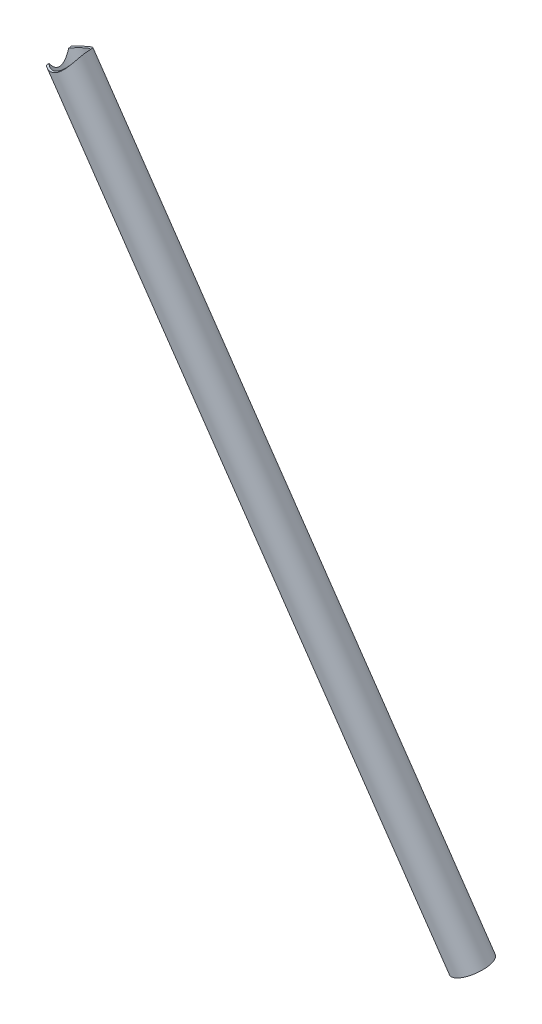
ISO-10303-21;
HEADER;
FILE_DESCRIPTION(('STEP AP214'),'2;1');
FILE_NAME('part.step','',(''),(''),'','','');
FILE_SCHEMA(('AUTOMOTIVE_DESIGN { 1 0 10303 214 1 1 1 1 }'));
ENDSEC;
DATA;
#1=APPLICATION_CONTEXT('core data for automotive mechanical design processes');
#2=APPLICATION_PROTOCOL_DEFINITION('international standard','automotive_design',2000,#1);
#3=PRODUCT_CONTEXT('',#1,'mechanical');
#4=PRODUCT('Part','Part','',(#3));
#5=PRODUCT_RELATED_PRODUCT_CATEGORY('part','',(#4));
#6=PRODUCT_DEFINITION_FORMATION('','',#4);
#7=PRODUCT_DEFINITION_CONTEXT('part definition',#1,'design');
#8=PRODUCT_DEFINITION('design','',#6,#7);
#9=PRODUCT_DEFINITION_SHAPE('','',#8);
#10=(LENGTH_UNIT() NAMED_UNIT(*) SI_UNIT(.MILLI.,.METRE.));
#11=(NAMED_UNIT(*) PLANE_ANGLE_UNIT() SI_UNIT($,.RADIAN.));
#12=(NAMED_UNIT(*) SI_UNIT($,.STERADIAN.) SOLID_ANGLE_UNIT());
#13=UNCERTAINTY_MEASURE_WITH_UNIT(LENGTH_MEASURE(1.E-05),#10,'distance_accuracy_value','');
#14=(GEOMETRIC_REPRESENTATION_CONTEXT(3) GLOBAL_UNCERTAINTY_ASSIGNED_CONTEXT((#13)) GLOBAL_UNIT_ASSIGNED_CONTEXT((#10,
#11,#12)) REPRESENTATION_CONTEXT('',''));
#15=CARTESIAN_POINT('',(0.,0.,0.));
#16=DIRECTION('',(0.,0.,1.));
#17=DIRECTION('',(1.,0.,0.));
#18=AXIS2_PLACEMENT_3D('',#15,#16,#17);
#19=CARTESIAN_POINT('',(15.0351503322684,521.737226724999,283.725227880223));
#20=DIRECTION('',(-0.025807832155009,0.13067423307069,-0.991089400917418));
#21=DIRECTION('',(-0.0275402605355425,0.99095038035367,0.131373047945732));
#22=AXIS2_PLACEMENT_3D('',#19,#20,#21);
#23=CYLINDRICAL_SURFACE('',#22,11.1125);
#24=CARTESIAN_POINT('',(24.7252163951127,515.029909267495,290.407107725878));
#25=CARTESIAN_POINT('',(24.7323279749911,515.01397883599,290.565639073504));
#26=CARTESIAN_POINT('',(24.7356435248489,514.991797183816,290.723713167724));
#27=CARTESIAN_POINT('',(24.734652464094,514.935150781067,291.037616266483));
#28=CARTESIAN_POINT('',(24.7303458633062,514.900686046325,291.193445273914));
#29=CARTESIAN_POINT('',(24.7141170765286,514.8200534236,291.501708249456));
#30=CARTESIAN_POINT('',(24.7021912873525,514.773880004704,291.654140575928));
#31=CARTESIAN_POINT('',(24.6707553996171,514.670724058833,291.954558815772));
#32=CARTESIAN_POINT('',(24.6512418901387,514.613736676548,292.102542697152));
#33=CARTESIAN_POINT('',(24.6048333676287,514.490477145692,292.392233072193));
#34=CARTESIAN_POINT('',(24.5779868072987,514.424267294314,292.533973915781));
#35=CARTESIAN_POINT('',(24.5169029313781,514.283473577166,292.811607206514));
#36=CARTESIAN_POINT('',(24.4826628261833,514.208886555778,292.947497422928));
#37=CARTESIAN_POINT('',(24.3689080405575,513.974423275426,293.345628003844));
#38=CARTESIAN_POINT('',(24.2783322768033,513.803771508296,293.598495189967));
#39=CARTESIAN_POINT('',(24.0568754012458,513.424843172808,294.100949894369));
#40=CARTESIAN_POINT('',(23.9228290349469,513.214504796005,294.347580943422));
#41=CARTESIAN_POINT('',(23.6945151438777,512.889991382476,294.690547523063));
#42=CARTESIAN_POINT('',(23.6138087207831,512.780245324311,294.800435413367));
#43=CARTESIAN_POINT('',(23.4431584649064,512.558952576729,295.010944749));
#44=CARTESIAN_POINT('',(23.3532129706991,512.447405566504,295.11156452149));
#45=CARTESIAN_POINT('',(23.1530614639427,512.210833219292,295.31423016615));
#46=CARTESIAN_POINT('',(23.0417156508309,512.085747625232,295.415083548591));
#47=CARTESIAN_POINT('',(22.8075487262916,511.8367803681,295.604018791155));
#48=CARTESIAN_POINT('',(22.6847323467235,511.712898231656,295.692105879721));
#49=CARTESIAN_POINT('',(22.42779400376,511.468073627988,295.854812388712));
#50=CARTESIAN_POINT('',(22.2936741101143,511.34713062779,295.929434266881));
#51=CARTESIAN_POINT('',(22.0145406073303,511.109953609795,296.064437899635));
#52=CARTESIAN_POINT('',(21.8695283841565,510.993718995779,296.124821461901));
#53=CARTESIAN_POINT('',(21.5800688472528,510.775805403807,296.226796524069));
#54=CARTESIAN_POINT('',(21.4363224455463,510.673679914623,296.269422942594));
#55=CARTESIAN_POINT('',(21.140900450593,510.476369333325,296.341180579815));
#56=CARTESIAN_POINT('',(20.9892251631707,510.381183973862,296.370312318588));
#57=CARTESIAN_POINT('',(20.6791858683787,510.19908602396,296.414626173658));
#58=CARTESIAN_POINT('',(20.5208274400097,510.112166722904,296.429819693556));
#59=CARTESIAN_POINT('',(20.1986688245854,509.947596696398,296.446035659298));
#60=CARTESIAN_POINT('',(20.0348692343442,509.869944958699,296.447059654218));
#61=CARTESIAN_POINT('',(19.7233956486199,509.733507121336,296.435631252214));
#62=CARTESIAN_POINT('',(19.5761606418642,509.673575212822,296.42478999255));
#63=CARTESIAN_POINT('',(19.2798011742933,509.56189490792,296.392232143844));
#64=CARTESIAN_POINT('',(19.1306767409935,509.510146392505,296.370515712996));
#65=CARTESIAN_POINT('',(18.8316993609169,509.415036717841,296.31644138339));
#66=CARTESIAN_POINT('',(18.6818464440169,509.371675217548,296.284083917477));
#67=CARTESIAN_POINT('',(18.3825308949109,509.293349528262,296.209064229124));
#68=CARTESIAN_POINT('',(18.2330682751422,509.258385603712,296.166401682259));
#69=CARTESIAN_POINT('',(17.9368462675909,509.196961200137,296.07157671821));
#70=CARTESIAN_POINT('',(17.7900747304203,509.170432219388,296.019496516607));
#71=CARTESIAN_POINT('',(17.4989228359527,509.125181436046,295.90604468985));
#72=CARTESIAN_POINT('',(17.3545432721467,509.106462176277,295.844670047303));
#73=CARTESIAN_POINT('',(16.9264216588675,509.061455403937,295.647305044781));
#74=CARTESIAN_POINT('',(16.6474926797553,509.046278090173,295.498007909168));
#75=CARTESIAN_POINT('',(16.0808259437231,509.041163817952,295.15015701178));
#76=CARTESIAN_POINT('',(15.7952490973984,509.054050498065,294.948073488554));
#77=CARTESIAN_POINT('',(15.2547601619044,509.104043560433,294.508564699055));
#78=CARTESIAN_POINT('',(14.9998840774663,509.141178058301,294.271098653358));
#79=CARTESIAN_POINT('',(14.5019860325536,509.237184975453,293.735313055107));
#80=CARTESIAN_POINT('',(14.26337663298,509.298004142303,293.433169871913));
#81=CARTESIAN_POINT('',(13.9495382830707,509.396014702563,292.953195617642));
#82=CARTESIAN_POINT('',(13.8522761802879,509.429812856624,292.788755448101));
#83=CARTESIAN_POINT('',(13.6739003127993,509.498214725531,292.451451416934));
#84=CARTESIAN_POINT('',(13.5927815003187,509.532818184777,292.278590209557));
#85=CARTESIAN_POINT('',(13.4639134711017,509.593971365636,291.96352986672));
#86=CARTESIAN_POINT('',(13.4127401430596,509.620650285813,291.822746864901));
#87=CARTESIAN_POINT('',(13.3220933445353,509.672931436003,291.537277188677));
#88=CARTESIAN_POINT('',(13.2826173762912,509.698533894872,291.392591354861));
#89=CARTESIAN_POINT('',(13.2160367924545,509.748052446225,291.100253373594));
#90=CARTESIAN_POINT('',(13.1889208128963,509.771970070594,290.952604081748));
#91=CARTESIAN_POINT('',(13.147478653559,509.817679147622,290.655185959703));
#92=CARTESIAN_POINT('',(13.1331526855551,509.839470565071,290.505417094449));
#93=CARTESIAN_POINT('',(13.1175188084756,509.880661240297,290.204588110799));
#94=CARTESIAN_POINT('',(13.1162351420492,509.900055977146,290.053526109965));
#95=CARTESIAN_POINT('',(13.1267242049562,509.936292883935,289.751552968335));
#96=CARTESIAN_POINT('',(13.1384969838443,509.953135044186,289.600641828115));
#97=CARTESIAN_POINT('',(13.174819750872,509.98435686082,289.300061418634));
#98=CARTESIAN_POINT('',(13.1993743277235,509.998735630371,289.150392614993));
#99=CARTESIAN_POINT('',(13.2607703023273,510.025292976521,288.853348378321));
#100=CARTESIAN_POINT('',(13.2976166671967,510.037470660589,288.705973897667));
#101=CARTESIAN_POINT('',(13.3823196415933,510.059864647886,288.41661156812));
#102=CARTESIAN_POINT('',(13.4300090393212,510.070106806317,288.274576615509));
#103=CARTESIAN_POINT('',(13.535978051725,510.089336773497,287.994406842118));
#104=CARTESIAN_POINT('',(13.5942611367829,510.098324169487,287.856273316588));
#105=CARTESIAN_POINT('',(13.78388208025,510.12421491902,287.448745319335));
#106=CARTESIAN_POINT('',(13.9300356601097,510.140057018185,287.186076624413));
#107=CARTESIAN_POINT('',(14.2816035241247,510.176168855485,286.643644412397));
#108=CARTESIAN_POINT('',(14.4927009073853,510.196743949514,286.367583843419));
#109=CARTESIAN_POINT('',(14.8374360671378,510.234629207713,285.979397120125));
#110=CARTESIAN_POINT('',(14.9571278646831,510.24844083397,285.854236256914));
#111=CARTESIAN_POINT('',(15.2051361902414,510.279219284787,285.613090081993));
#112=CARTESIAN_POINT('',(15.3334541859967,510.296186647166,285.497106339111));
#113=CARTESIAN_POINT('',(15.6140154682449,510.336352607303,285.261434716198));
#114=CARTESIAN_POINT('',(15.7672654167405,510.360059530498,285.143028991462));
#115=CARTESIAN_POINT('',(16.0822557435483,510.413375129501,284.919713250058));
#116=CARTESIAN_POINT('',(16.2439927618229,510.442981482512,284.814797948442));
#117=CARTESIAN_POINT('',(16.5746943099166,510.508953532469,284.619500125246));
#118=CARTESIAN_POINT('',(16.7436579248454,510.545318375724,284.529115770896));
#119=CARTESIAN_POINT('',(17.0873696631691,510.625501969115,284.36399655714));
#120=CARTESIAN_POINT('',(17.2621171224285,510.669319865821,284.289259908141));
#121=CARTESIAN_POINT('',(17.6049911551176,510.761980683825,284.160575748001));
#122=CARTESIAN_POINT('',(17.7728728599078,510.810355086212,284.105639381951));
#123=CARTESIAN_POINT('',(18.1107918811863,510.914295752527,284.01136292293));
#124=CARTESIAN_POINT('',(18.2808291344433,510.969861805933,283.972022373555));
#125=CARTESIAN_POINT('',(18.6212660743231,511.088087254652,283.9096391246));
#126=CARTESIAN_POINT('',(18.7916653162436,511.150740429232,283.886582258809));
#127=CARTESIAN_POINT('',(19.1312483446188,511.282871809666,283.857158162195));
#128=CARTESIAN_POINT('',(19.3004322751093,511.352349191916,283.85078891993));
#129=CARTESIAN_POINT('',(19.6150949624502,511.488564229659,283.854635485356));
#130=CARTESIAN_POINT('',(19.76091560847,511.554576362402,283.862895826967));
#131=CARTESIAN_POINT('',(20.0492282721972,511.690876450904,283.89225398734));
#132=CARTESIAN_POINT('',(20.191720367673,511.761164306625,283.913351505861));
#133=CARTESIAN_POINT('',(20.4723674740059,511.905365972105,283.968123384607));
#134=CARTESIAN_POINT('',(20.6105227531925,511.979279556803,284.00179696505));
#135=CARTESIAN_POINT('',(20.881648456471,512.130006033375,284.081308067545));
#136=CARTESIAN_POINT('',(21.0146187461448,512.206819000312,284.127145904709));
#137=CARTESIAN_POINT('',(21.2723437668193,512.361164626129,284.229535966082));
#138=CARTESIAN_POINT('',(21.3972028161609,512.438659926269,284.285882198338));
#139=CARTESIAN_POINT('',(21.640736791097,512.594913003224,284.409220901092));
#140=CARTESIAN_POINT('',(21.7594096938806,512.673671182116,284.476216825298));
#141=CARTESIAN_POINT('',(22.1054756423195,512.910616137956,284.692247382908));
#142=CARTESIAN_POINT('',(22.3230977520452,513.069583704717,284.856398203566));
#143=CARTESIAN_POINT('',(22.750569471247,513.398652385329,285.23800608341));
#144=CARTESIAN_POINT('',(22.9574570122535,513.568273713616,285.459155682984));
#145=CARTESIAN_POINT('',(23.3371929304476,513.893775509721,285.938392526818));
#146=CARTESIAN_POINT('',(23.5100043322094,514.049640951092,286.196519375988));
#147=CARTESIAN_POINT('',(23.7526386337022,514.274318321607,286.622891814294));
#148=CARTESIAN_POINT('',(23.8342181290308,514.35115415025,286.780427348649));
#149=CARTESIAN_POINT('',(23.98693945977,514.49594612228,287.104504034856));
#150=CARTESIAN_POINT('',(24.0580788176747,514.563900157548,287.271047311507));
#151=CARTESIAN_POINT('',(24.1898579311647,514.689015192206,287.612033742643));
#152=CARTESIAN_POINT('',(24.25050370529,514.746182380052,287.786472295915));
#153=CARTESIAN_POINT('',(24.361278742731,514.847823324948,288.142157757021));
#154=CARTESIAN_POINT('',(24.4114151573083,514.892305721044,288.323399935553));
#155=CARTESIAN_POINT('',(24.493682023257,514.960555280577,288.660965535446));
#156=CARTESIAN_POINT('',(24.5274190366291,514.986531686295,288.816453095353));
#157=CARTESIAN_POINT('',(24.587413721282,515.027314179016,289.130244379657));
#158=CARTESIAN_POINT('',(24.6136754852917,515.042126385812,289.288546512425));
#159=CARTESIAN_POINT('',(24.6586127974892,515.059748551718,289.606745350198));
#160=CARTESIAN_POINT('',(24.6772955226889,515.062569889759,289.766640399047));
#161=CARTESIAN_POINT('',(24.7070112467207,515.055683229131,290.086881232234));
#162=CARTESIAN_POINT('',(24.7180442839283,515.045975293318,290.247227014305));
#163=CARTESIAN_POINT('',(24.7252163951127,515.029909267495,290.407107725878));
#164=B_SPLINE_CURVE_WITH_KNOTS('',3,(#24,#25,#26,#27,#28,#29,#30,#31,#32,#33,#34,#35,#36,#37,
#38,#39,#40,#41,#42,#43,#44,#45,#46,#47,#48,#49,#50,#51,#52,#53,#54,#55,#56,#57,#58,#59,#60,#61,
#62,#63,#64,#65,#66,#67,#68,#69,#70,#71,#72,#73,#74,#75,#76,#77,#78,#79,#80,#81,#82,#83,#84,#85,
#86,#87,#88,#89,#90,#91,#92,#93,#94,#95,#96,#97,#98,#99,#100,#101,#102,#103,#104,#105,#106,#107,
#108,#109,#110,#111,#112,#113,#114,#115,#116,#117,#118,#119,#120,#121,#122,#123,#124,#125,#126,
#127,#128,#129,#130,#131,#132,#133,#134,#135,#136,#137,#138,#139,#140,#141,#142,#143,#144,#145,
#146,#147,#148,#149,#150,#151,#152,#153,#154,#155,#156,#157,#158,#159,#160,#161,#162,#163),
.UNSPECIFIED.,.T.,.F.,(4,2,2,2,2,2,2,2,2,2,2,2,2,2,2,2,2,2,2,2,2,2,2,2,2,2,2,2,2,2,2,2,2,2,2,2,
2,2,2,2,2,2,2,2,2,2,2,2,2,2,2,2,2,2,2,2,2,2,2,2,2,2,2,2,2,2,2,2,2,4),(0.,0.478297612294535,
0.956594608077915,1.435117962641,1.91385667766053,2.3895056343558,2.86533436923736,
3.81644521031909,4.86441517873111,5.38907969370448,5.91383872271919,6.49956495347832,
7.08505061770699,7.67042930751637,8.2557336381903,8.79918974478956,9.34262490522389,
9.88561505483835,10.4285458419421,10.9059672571717,11.383381727763,11.8607767809716,
12.3381868655482,12.8116144504028,13.2851960619561,14.231711732552,15.2778136761318,
16.3251307455571,17.4880315710523,18.0694090006118,18.6506043551841,19.1066039308711,
19.5625060657216,20.0179881873727,20.4734778506953,20.9298140103563,21.3861519020153,
21.8426537337386,22.2993402619771,22.7494117812481,23.1996310058749,24.0996132178747,
25.1396790954679,25.6604800223998,26.1813697886757,26.7659721610039,27.3503448097648,
27.9346436944306,28.5188757176009,29.0675289882367,29.6161662016176,30.1643255306841,
30.7124187843174,31.1926633992875,31.6728967825418,32.1531003937591,32.63331644572,
33.1049553855228,33.5767475916081,34.5196642108363,35.5570304122959,36.5955161214292,
37.1749244925082,37.7544701390261,38.3336822803769,38.9124989988574,39.3955934331605,
39.8784228603171,40.3607939961995,40.8431627121861),.UNSPECIFIED.);
#165=CARTESIAN_POINT('',(15.3105922221532,510.293544462506,285.520160320601));
#166=VERTEX_POINT('',#165);
#167=CARTESIAN_POINT('',(15.5509177758199,509.07669070958,294.749300822527));
#168=VERTEX_POINT('',#167);
#169=EDGE_CURVE('E83',#166,#168,#164,.T.);
#170=ORIENTED_EDGE('',*,*,#169,.F.);
#171=DIRECTION('',(-0.025807832155009,0.13067423307069,-0.991089400917418));
#172=VECTOR('',#171,1.);
#173=CARTESIAN_POINT('',(15.2259053312563,510.722344311041,282.267958451786));
#174=LINE('',#173,#172);
#175=CARTESIAN_POINT('',(15.3371595362422,510.159024702284,286.540415847929));
#176=VERTEX_POINT('',#175);
#177=EDGE_CURVE('E77',#166,#176,#174,.F.);
#178=ORIENTED_EDGE('',*,*,#177,.T.);
#179=CARTESIAN_POINT('',(24.2599339885423,514.327498487421,290.347925247683));
#180=CARTESIAN_POINT('',(24.2665977678887,514.312570832167,290.492243587058));
#181=CARTESIAN_POINT('',(24.2694720972503,514.292353620912,290.636193405875));
#182=CARTESIAN_POINT('',(24.267616103634,514.241517199068,290.92224958169));
#183=CARTESIAN_POINT('',(24.2628827370719,514.210893829189,291.064355177946));
#184=CARTESIAN_POINT('',(24.2458123478311,514.139669673822,291.345771646786));
#185=CARTESIAN_POINT('',(24.2334652944163,514.09905576869,291.485078581828));
#186=CARTESIAN_POINT('',(24.2012057233069,514.00856293883,291.759805391615));
#187=CARTESIAN_POINT('',(24.1812899712415,513.958680057807,291.895223577914));
#188=CARTESIAN_POINT('',(24.1340946042865,513.850836942013,292.160583096472));
#189=CARTESIAN_POINT('',(24.1068562437847,513.792922813076,292.290550534206));
#190=CARTESIAN_POINT('',(24.0450441117905,513.669775723568,292.545185858064));
#191=CARTESIAN_POINT('',(24.0104674765928,513.604539910463,292.669851652396));
#192=CARTESIAN_POINT('',(23.8958457066885,513.39940857597,293.035008368291));
#193=CARTESIAN_POINT('',(23.8048681425951,513.24999352205,293.266887487285));
#194=CARTESIAN_POINT('',(23.5858290415486,512.921470312976,293.721726662987));
#195=CARTESIAN_POINT('',(23.4553851877204,512.740943518084,293.942493545481));
#196=CARTESIAN_POINT('',(23.1609983474969,512.369266927789,294.350698860492));
#197=CARTESIAN_POINT('',(22.9970371613492,512.178111402263,294.53811908208));
#198=CARTESIAN_POINT('',(22.7188064484503,511.882288041986,294.798823841131));
#199=CARTESIAN_POINT('',(22.6160551952581,511.778004085769,294.885134856778));
#200=CARTESIAN_POINT('',(22.4010404019433,511.57046392781,295.046363797508));
#201=CARTESIAN_POINT('',(22.2887804713344,511.467207352557,295.121286015887));
#202=CARTESIAN_POINT('',(22.0550682585301,511.263153377807,295.259131168239));
#203=CARTESIAN_POINT('',(21.9336173439999,511.162355615366,295.322055882616));
#204=CARTESIAN_POINT('',(21.6820071828257,510.964616618028,295.435306590086));
#205=CARTESIAN_POINT('',(21.5518487943076,510.867675004603,295.485633822357));
#206=CARTESIAN_POINT('',(21.2916778609139,510.684741908099,295.570459860081));
#207=CARTESIAN_POINT('',(21.1621339396625,510.598442824795,295.605732720474));
#208=CARTESIAN_POINT('',(20.8968072925251,510.431548212373,295.664234523182));
#209=CARTESIAN_POINT('',(20.7610252326286,510.350952076724,295.687464747941));
#210=CARTESIAN_POINT('',(20.4842875904614,510.196479485184,295.721569330284));
#211=CARTESIAN_POINT('',(20.3433350243739,510.122599196457,295.732450776748));
#212=CARTESIAN_POINT('',(20.0573518149983,509.982336670433,295.74171741672));
#213=CARTESIAN_POINT('',(19.9123214913752,509.915953847428,295.740103587055));
#214=CARTESIAN_POINT('',(19.6335654556257,509.797312214985,295.72514185474));
#215=CARTESIAN_POINT('',(19.5000931035253,509.744309118542,295.71293675324));
#216=CARTESIAN_POINT('',(19.2318357035216,509.645235915631,295.678436878667));
#217=CARTESIAN_POINT('',(19.0970502556067,509.599167996933,295.656138930559));
#218=CARTESIAN_POINT('',(18.8272862817447,509.514161913727,295.601682314703));
#219=CARTESIAN_POINT('',(18.6923078450643,509.475221132656,295.569527277399));
#220=CARTESIAN_POINT('',(18.4230607059244,509.404439817625,295.495645323635));
#221=CARTESIAN_POINT('',(18.288792296173,509.372602018241,295.453914733182));
#222=CARTESIAN_POINT('',(18.0219877756401,509.315916415236,295.361255191621));
#223=CARTESIAN_POINT('',(17.8894514206833,509.291067615984,295.310327552394));
#224=CARTESIAN_POINT('',(17.6269725579787,509.248089576918,295.19966991556));
#225=CARTESIAN_POINT('',(17.4970309799625,509.229962706159,295.139936824933));
#226=CARTESIAN_POINT('',(17.1124140168243,509.185175737832,294.948148719384));
#227=CARTESIAN_POINT('',(16.8627708806616,509.168073268453,294.803443667686));
#228=CARTESIAN_POINT('',(16.3613966334699,509.155179810693,294.469052480063));
#229=CARTESIAN_POINT('',(16.1115701027324,509.161485121368,294.276459728523));
#230=CARTESIAN_POINT('',(15.6421365658873,509.19434648289,293.858344966381));
#231=CARTESIAN_POINT('',(15.4225544263923,509.220919081324,293.632796169943));
#232=CARTESIAN_POINT('',(15.1136820342353,509.272439217976,293.263159952051));
#233=CARTESIAN_POINT('',(15.0109605312589,509.292498986694,293.129395679525));
#234=CARTESIAN_POINT('',(14.8176285893567,509.335586988886,292.853858104151));
#235=CARTESIAN_POINT('',(14.7270130468281,509.358613963358,292.712088212383));
#236=CARTESIAN_POINT('',(14.5591092006629,509.40658231322,292.421189695313));
#237=CARTESIAN_POINT('',(14.4818191632677,509.431523438953,292.27206203057));
#238=CARTESIAN_POINT('',(14.3418224158107,509.482268528862,291.96733387457));
#239=CARTESIAN_POINT('',(14.2791069063427,509.508071961596,291.811737356153));
#240=CARTESIAN_POINT('',(14.1728142843882,509.557963175026,291.50498965095));
#241=CARTESIAN_POINT('',(14.1282850343721,509.582057259426,291.354169719927));
#242=CARTESIAN_POINT('',(14.0538682898824,509.629435482211,291.048905548497));
#243=CARTESIAN_POINT('',(14.0239729304103,509.652720049407,290.894463301784));
#244=CARTESIAN_POINT('',(13.9793987005993,509.697919815873,290.583293175973));
#245=CARTESIAN_POINT('',(13.9647105423212,509.719835843297,290.42656675135));
#246=CARTESIAN_POINT('',(13.9508015035554,509.761955073257,290.112207198471));
#247=CARTESIAN_POINT('',(13.9515791224949,509.782158441773,289.954574159663));
#248=CARTESIAN_POINT('',(13.9674728651156,509.818347966462,289.659361805479));
#249=CARTESIAN_POINT('',(13.9808072155842,509.834546848939,289.521708954535));
#250=CARTESIAN_POINT('',(14.0190337356978,509.865609367146,289.247823915433));
#251=CARTESIAN_POINT('',(14.0439295195598,509.880472583598,289.111592185158));
#252=CARTESIAN_POINT('',(14.1048520432464,509.909048136797,288.84153689874));
#253=CARTESIAN_POINT('',(14.1408775589233,509.922760599903,288.707713079467));
#254=CARTESIAN_POINT('',(14.2235055484344,509.949338985159,288.443267006553));
#255=CARTESIAN_POINT('',(14.2701121835833,509.962204571676,288.312646034974));
#256=CARTESIAN_POINT('',(14.427558604508,510.000732586414,287.920097352536));
#257=CARTESIAN_POINT('',(14.5544461188671,510.025641783151,287.664363558943));
#258=CARTESIAN_POINT('',(14.8444781929245,510.077293499904,287.174748933466));
#259=CARTESIAN_POINT('',(15.0076393569071,510.104036855619,286.940878179266));
#260=CARTESIAN_POINT('',(15.3883368582892,510.167401348712,286.469850672099));
#261=CARTESIAN_POINT('',(15.6101991970098,510.204858240379,286.236291248842));
#262=CARTESIAN_POINT('',(16.0864646451804,510.293113208736,285.807554105623));
#263=CARTESIAN_POINT('',(16.3408836243684,510.343917804569,285.61239522253));
#264=CARTESIAN_POINT('',(16.7471880057849,510.435006016121,285.349069510807));
#265=CARTESIAN_POINT('',(16.8902312752328,510.468785735717,285.26467399613));
#266=CARTESIAN_POINT('',(17.1819140991429,510.541800238342,285.108965440312));
#267=CARTESIAN_POINT('',(17.3305512391346,510.581032687073,285.037646831128));
#268=CARTESIAN_POINT('',(17.6320759966652,510.665330558691,284.908975042953));
#269=CARTESIAN_POINT('',(17.7849617483509,510.710393451857,284.851615838148));
#270=CARTESIAN_POINT('',(18.0936196826945,510.806575135967,284.751623822215));
#271=CARTESIAN_POINT('',(18.2493915173544,510.857693200749,284.708989247641));
#272=CARTESIAN_POINT('',(18.5488528797145,510.961336411961,284.642113952171));
#273=CARTESIAN_POINT('',(18.6924328867322,511.013364902736,284.616609317874));
#274=CARTESIAN_POINT('',(18.9794762034642,511.122309771902,284.578840127703));
#275=CARTESIAN_POINT('',(19.1229395225837,511.17922570643,284.566574370886));
#276=CARTESIAN_POINT('',(19.4084461062326,511.297588522602,284.555486966842));
#277=CARTESIAN_POINT('',(19.5504898952338,511.359033654832,284.556660155547));
#278=CARTESIAN_POINT('',(19.8319906867442,511.485978700238,284.572449453974));
#279=CARTESIAN_POINT('',(19.971447804667,511.551478431936,284.587064962439));
#280=CARTESIAN_POINT('',(20.2357144511774,511.680560723792,284.62786359478));
#281=CARTESIAN_POINT('',(20.3608084148861,511.743883257964,284.653037229663));
#282=CARTESIAN_POINT('',(20.6070901879322,511.872867447203,284.714346096011));
#283=CARTESIAN_POINT('',(20.7282767495852,511.938529835598,284.750484791157));
#284=CARTESIAN_POINT('',(20.9659855971738,512.071519653263,284.833325726752));
#285=CARTESIAN_POINT('',(21.0825092932786,512.138846569019,284.880024744637));
#286=CARTESIAN_POINT('',(21.3103901575126,512.274511799566,284.983519094897));
#287=CARTESIAN_POINT('',(21.4217453253371,512.342850492656,285.040318295794));
#288=CARTESIAN_POINT('',(21.7537094890732,512.552354855466,285.228730927236));
#289=CARTESIAN_POINT('',(21.9653250130004,512.694111343246,285.375941427098));
#290=CARTESIAN_POINT('',(22.3620506988447,512.972622323356,285.706129787652));
#291=CARTESIAN_POINT('',(22.5471504855472,513.109374842209,285.889121583158));
#292=CARTESIAN_POINT('',(22.9071665716996,513.384793126425,286.306244325203));
#293=CARTESIAN_POINT('',(23.079184875628,513.522267239188,286.543668006062));
#294=CARTESIAN_POINT('',(23.3896127814508,513.77482934488,287.050881920683));
#295=CARTESIAN_POINT('',(23.5279870536688,513.889893780349,287.320705737674));
#296=CARTESIAN_POINT('',(23.7128206043828,514.04087960777,287.752024676643));
#297=CARTESIAN_POINT('',(23.7717682701816,514.088470253885,287.904282456697));
#298=CARTESIAN_POINT('',(23.8800311110231,514.173331814476,288.214945879791));
#299=CARTESIAN_POINT('',(23.9293510044035,514.210607787681,288.373348465553));
#300=CARTESIAN_POINT('',(24.0181012075182,514.273395190445,288.694744354279));
#301=CARTESIAN_POINT('',(24.0575558165352,514.2989356586,288.857725255396));
#302=CARTESIAN_POINT('',(24.1265318467687,514.337150210375,289.187179844928));
#303=CARTESIAN_POINT('',(24.1560599006286,514.349832896668,289.353651121845));
#304=CARTESIAN_POINT('',(24.2005957087189,514.360370722131,289.658229656227));
#305=CARTESIAN_POINT('',(24.2172638227149,514.360492959357,289.796020742711));
#306=CARTESIAN_POINT('',(24.2437515547488,514.351184701362,290.071961631117));
#307=CARTESIAN_POINT('',(24.2535705516675,514.341753339953,290.210111464432));
#308=CARTESIAN_POINT('',(24.2599339885423,514.327498487421,290.347925247683));
#309=B_SPLINE_CURVE_WITH_KNOTS('',3,(#179,#180,#181,#182,#183,#184,#185,#186,#187,#188,#189,
#190,#191,#192,#193,#194,#195,#196,#197,#198,#199,#200,#201,#202,#203,#204,#205,#206,#207,#208,
#209,#210,#211,#212,#213,#214,#215,#216,#217,#218,#219,#220,#221,#222,#223,#224,#225,#226,#227,
#228,#229,#230,#231,#232,#233,#234,#235,#236,#237,#238,#239,#240,#241,#242,#243,#244,#245,#246,
#247,#248,#249,#250,#251,#252,#253,#254,#255,#256,#257,#258,#259,#260,#261,#262,#263,#264,#265,
#266,#267,#268,#269,#270,#271,#272,#273,#274,#275,#276,#277,#278,#279,#280,#281,#282,#283,#284,
#285,#286,#287,#288,#289,#290,#291,#292,#293,#294,#295,#296,#297,#298,#299,#300,#301,#302,#303,
#304,#305,#306,#307,#308),.UNSPECIFIED.,.T.,.F.,(4,2,2,2,2,2,2,2,2,2,2,2,2,2,2,2,2,2,2,2,2,2,2,
2,2,2,2,2,2,2,2,2,2,2,2,2,2,2,2,2,2,2,2,2,2,2,2,2,2,2,2,2,2,2,2,2,2,2,2,2,2,2,2,2,4),(0.,
0.43558372343787,0.871341752700672,1.30767510640706,1.74419513073385,2.17830562069867,
2.61258583147993,3.48040058914051,4.41755794629318,5.3552255336173,5.86452667247533,
6.37363533863774,6.88266839523518,7.39165136005662,7.86980711480163,8.34791193928061,
8.82574216612813,9.30353503861279,9.73540199228342,10.1674048983194,10.5992488849731,
11.0312588413633,11.4632072237954,11.8953076963683,12.7589467589771,13.7017187635217,
14.6452613361416,15.1542563935381,15.663036188238,16.1717497364345,16.6801553450075,
17.1567419283294,17.6330720877358,18.1091111521525,18.58510402893,19.0023410240711,
19.419708539465,19.8370301653696,20.2545161996024,21.1105270917552,21.966930633154,
22.9357346025278,23.9050126273445,24.4128943215794,24.9205592590503,25.4280046641078,
25.9353892755737,26.3992594690122,26.8630875796887,27.3267374650925,27.7903666130726,
28.2172210344291,28.6442104326432,29.0710697071432,29.4980928286678,30.3766936284706,
31.2556372781597,32.223007481715,33.1913891776222,33.7010062456463,34.210372932225,
34.7184723516716,35.2262315955212,35.6421454598224,36.0580970368),.UNSPECIFIED.);
#310=CARTESIAN_POINT('',(15.5243504617309,509.211210469802,293.729045295199));
#311=VERTEX_POINT('',#310);
#312=EDGE_CURVE('E76',#176,#311,#309,.T.);
#313=ORIENTED_EDGE('',*,*,#312,.T.);
#314=EDGE_CURVE('E70',#311,#168,#174,.F.);
#315=ORIENTED_EDGE('',*,*,#314,.T.);
#316=EDGE_LOOP('',(#170,#178,#313,#315));
#317=FACE_BOUND('',#316,.T.);
#318=ADVANCED_FACE('F44',(#317),#23,.F.);
#319=CARTESIAN_POINT('',(19.731517611858,510.638681258727,290.148465802662));
#320=DIRECTION('',(0.404186061809487,-0.905405511025666,-0.129901840030428));
#321=DIRECTION('',(0.913142697932828,0.407640053493221,0.));
#322=AXIS2_PLACEMENT_3D('',#319,#320,#321);
#323=CYLINDRICAL_SURFACE('',#322,6.35000000000001);
#324=CARTESIAN_POINT('',(128.630780764416,266.696590421774,255.149201854409));
#325=DIRECTION('',(-0.404186061809487,0.905405511025666,0.129901840030429));
#326=DIRECTION('',(-0.913142697932828,-0.407640053493221,0.));
#327=AXIS2_PLACEMENT_3D('',#324,#325,#326);
#328=CIRCLE('',#327,6.35000000000001);
#329=CARTESIAN_POINT('',(122.832324632542,264.108076082092,255.149201854409));
#330=VERTEX_POINT('',#329);
#331=EDGE_CURVE('E48',#330,#330,#328,.T.);
#332=ORIENTED_EDGE('',*,*,#331,.T.);
#333=EDGE_LOOP('',(#332));
#334=FACE_BOUND('',#333,.T.);
#335=ORIENTED_EDGE('',*,*,#169,.T.);
#336=CARTESIAN_POINT('',(15.2399999999986,520.700000000003,291.592000000001));
#337=DIRECTION('',(0.999519530057415,0.0203972303696372,-0.0233379953520305));
#338=DIRECTION('',(0.0171658041833844,-0.991215515316743,-0.131137856327235));
#339=AXIS2_PLACEMENT_3D('',#336,#337,#338);
#340=ELLIPSE('',#339,16.3425713307169,6.35000000000001);
#341=EDGE_CURVE('E62',#168,#166,#340,.T.);
#342=ORIENTED_EDGE('',*,*,#341,.T.);
#343=EDGE_LOOP('',(#335,#342));
#344=FACE_BOUND('',#343,.T.);
#345=ADVANCED_FACE('F98',(#334,#344),#323,.T.);
#346=CARTESIAN_POINT('',(19.731517611858,510.638681258727,290.148465802662));
#347=DIRECTION('',(0.404186061809487,-0.905405511025666,-0.129901840030428));
#348=DIRECTION('',(0.913142697932828,0.407640053493221,0.));
#349=AXIS2_PLACEMENT_3D('',#346,#347,#348);
#350=CYLINDRICAL_SURFACE('',#349,5.6388);
#351=CARTESIAN_POINT('',(128.630780764416,266.696590421774,255.149201854409));
#352=DIRECTION('',(-0.404186061809487,0.905405511025666,0.129901840030429));
#353=DIRECTION('',(-0.913142697932828,-0.407640053493221,0.));
#354=AXIS2_PLACEMENT_3D('',#351,#352,#353);
#355=CIRCLE('',#354,5.6388);
#356=CARTESIAN_POINT('',(123.481751719312,264.397989688137,255.149201854409));
#357=VERTEX_POINT('',#356);
#358=EDGE_CURVE('E13',#357,#357,#355,.T.);
#359=ORIENTED_EDGE('',*,*,#358,.F.);
#360=EDGE_LOOP('',(#359));
#361=FACE_BOUND('',#360,.T.);
#362=CARTESIAN_POINT('',(15.2399999999986,520.700000000003,291.592000000001));
#363=DIRECTION('',(0.999519530057415,0.0203972303696372,-0.0233379953520305));
#364=DIRECTION('',(0.0171658041833844,-0.991215515316743,-0.131137856327235));
#365=AXIS2_PLACEMENT_3D('',#362,#363,#364);
#366=ELLIPSE('',#365,14.5122033416766,5.6388);
#367=EDGE_CURVE('E54',#311,#176,#366,.T.);
#368=ORIENTED_EDGE('',*,*,#367,.F.);
#369=ORIENTED_EDGE('',*,*,#312,.F.);
#370=EDGE_LOOP('',(#368,#369));
#371=FACE_BOUND('',#370,.T.);
#372=ADVANCED_FACE('F81',(#361,#371),#350,.F.);
#373=CARTESIAN_POINT('',(19.0391905947067,0.388533435248983,-0.444550134583325));
#374=DIRECTION('',(0.999519530057415,0.0203972303696372,-0.0233379953520305));
#375=DIRECTION('',(-0.0233428517189956,0.,-0.999727518513732));
#376=AXIS2_PLACEMENT_3D('',#373,#374,#375);
#377=PLANE('',#376);
#378=ORIENTED_EDGE('',*,*,#314,.F.);
#379=ORIENTED_EDGE('',*,*,#367,.T.);
#380=ORIENTED_EDGE('',*,*,#177,.F.);
#381=ORIENTED_EDGE('',*,*,#341,.F.);
#382=EDGE_LOOP('',(#378,#379,#380,#381));
#383=FACE_BOUND('',#382,.T.);
#384=ADVANCED_FACE('F72',(#383),#377,.F.);
#385=CARTESIAN_POINT('',(128.630780764416,266.696590421774,255.149201854409));
#386=DIRECTION('',(-0.404186061809487,0.905405511025666,0.129901840030429));
#387=DIRECTION('',(-0.913142697932828,-0.407640053493221,0.));
#388=AXIS2_PLACEMENT_3D('',#385,#386,#387);
#389=PLANE('',#388);
#390=ORIENTED_EDGE('',*,*,#358,.T.);
#391=EDGE_LOOP('',(#390));
#392=FACE_BOUND('',#391,.T.);
#393=ORIENTED_EDGE('',*,*,#331,.F.);
#394=EDGE_LOOP('',(#393));
#395=FACE_BOUND('',#394,.T.);
#396=ADVANCED_FACE('F46',(#392,#395),#389,.F.);
#397=CLOSED_SHELL('',(#318,#345,#372,#384,#396));
#398=MANIFOLD_SOLID_BREP('B2',#397);
#399=ADVANCED_BREP_SHAPE_REPRESENTATION('',(#18,#398),#14);
#400=SHAPE_DEFINITION_REPRESENTATION(#9,#399);
ENDSEC;
END-ISO-10303-21;
